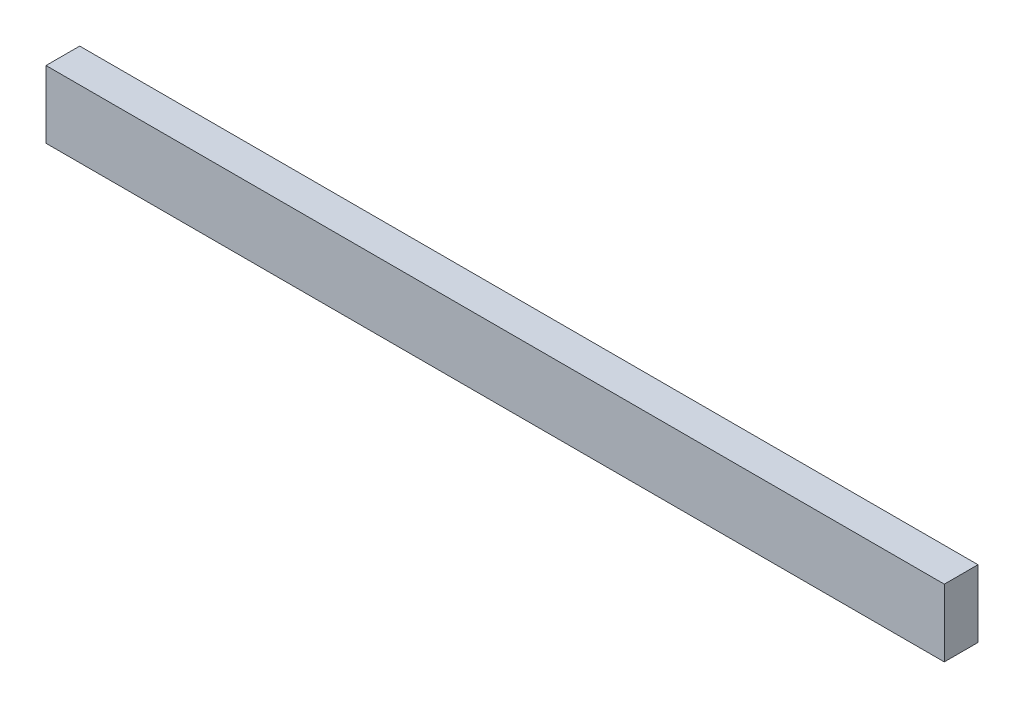
ISO-10303-21;
HEADER;
FILE_DESCRIPTION(('STEP AP214'),'2;1');
FILE_NAME('part.step','',(''),(''),'','','');
FILE_SCHEMA(('AUTOMOTIVE_DESIGN { 1 0 10303 214 1 1 1 1 }'));
ENDSEC;
DATA;
#1=APPLICATION_CONTEXT('core data for automotive mechanical design processes');
#2=APPLICATION_PROTOCOL_DEFINITION('international standard','automotive_design',2000,#1);
#3=PRODUCT_CONTEXT('',#1,'mechanical');
#4=PRODUCT('Part','Part','',(#3));
#5=PRODUCT_RELATED_PRODUCT_CATEGORY('part','',(#4));
#6=PRODUCT_DEFINITION_FORMATION('','',#4);
#7=PRODUCT_DEFINITION_CONTEXT('part definition',#1,'design');
#8=PRODUCT_DEFINITION('design','',#6,#7);
#9=PRODUCT_DEFINITION_SHAPE('','',#8);
#10=(LENGTH_UNIT() NAMED_UNIT(*) SI_UNIT(.MILLI.,.METRE.));
#11=(NAMED_UNIT(*) PLANE_ANGLE_UNIT() SI_UNIT($,.RADIAN.));
#12=(NAMED_UNIT(*) SI_UNIT($,.STERADIAN.) SOLID_ANGLE_UNIT());
#13=UNCERTAINTY_MEASURE_WITH_UNIT(LENGTH_MEASURE(1.E-05),#10,'distance_accuracy_value','');
#14=(GEOMETRIC_REPRESENTATION_CONTEXT(3) GLOBAL_UNCERTAINTY_ASSIGNED_CONTEXT((#13)) GLOBAL_UNIT_ASSIGNED_CONTEXT((#10,
#11,#12)) REPRESENTATION_CONTEXT('',''));
#15=CARTESIAN_POINT('',(0.,0.,0.));
#16=DIRECTION('',(0.,0.,1.));
#17=DIRECTION('',(1.,0.,0.));
#18=AXIS2_PLACEMENT_3D('',#15,#16,#17);
#19=CARTESIAN_POINT('',(40.,3.,3.));
#20=DIRECTION('',(-1.,0.,0.));
#21=DIRECTION('',(0.,0.,1.));
#22=AXIS2_PLACEMENT_3D('',#19,#20,#21);
#23=PLANE('',#22);
#24=DIRECTION('',(0.,1.,0.));
#25=VECTOR('',#24,1.);
#26=CARTESIAN_POINT('',(40.,3.,0.));
#27=LINE('',#26,#25);
#28=CARTESIAN_POINT('',(40.,-3.,0.));
#29=VERTEX_POINT('',#28);
#30=CARTESIAN_POINT('',(40.,3.,0.));
#31=VERTEX_POINT('',#30);
#32=EDGE_CURVE('E95',#29,#31,#27,.T.);
#33=ORIENTED_EDGE('',*,*,#32,.T.);
#34=DIRECTION('',(0.,0.,-1.));
#35=VECTOR('',#34,1.);
#36=CARTESIAN_POINT('',(40.,3.,3.));
#37=LINE('',#36,#35);
#38=CARTESIAN_POINT('',(40.,3.,3.));
#39=VERTEX_POINT('',#38);
#40=EDGE_CURVE('E11',#39,#31,#37,.T.);
#41=ORIENTED_EDGE('',*,*,#40,.F.);
#42=DIRECTION('',(0.,1.,0.));
#43=VECTOR('',#42,1.);
#44=CARTESIAN_POINT('',(40.,3.,3.));
#45=LINE('',#44,#43);
#46=CARTESIAN_POINT('',(40.,-3.,3.));
#47=VERTEX_POINT('',#46);
#48=EDGE_CURVE('E83',#47,#39,#45,.T.);
#49=ORIENTED_EDGE('',*,*,#48,.F.);
#50=DIRECTION('',(0.,0.,-1.));
#51=VECTOR('',#50,1.);
#52=CARTESIAN_POINT('',(40.,-3.,3.));
#53=LINE('',#52,#51);
#54=EDGE_CURVE('E91',#47,#29,#53,.T.);
#55=ORIENTED_EDGE('',*,*,#54,.T.);
#56=EDGE_LOOP('',(#33,#41,#49,#55));
#57=FACE_BOUND('',#56,.T.);
#58=ADVANCED_FACE('F32',(#57),#23,.F.);
#59=CARTESIAN_POINT('',(-40.,3.,3.));
#60=DIRECTION('',(0.,-1.,0.));
#61=DIRECTION('',(0.,0.,-1.));
#62=AXIS2_PLACEMENT_3D('',#59,#60,#61);
#63=PLANE('',#62);
#64=DIRECTION('',(-1.,0.,0.));
#65=VECTOR('',#64,1.);
#66=CARTESIAN_POINT('',(-40.,3.,0.));
#67=LINE('',#66,#65);
#68=CARTESIAN_POINT('',(-40.,3.,0.));
#69=VERTEX_POINT('',#68);
#70=EDGE_CURVE('E87',#31,#69,#67,.T.);
#71=ORIENTED_EDGE('',*,*,#70,.T.);
#72=DIRECTION('',(0.,0.,-1.));
#73=VECTOR('',#72,1.);
#74=CARTESIAN_POINT('',(-40.,3.,3.));
#75=LINE('',#74,#73);
#76=CARTESIAN_POINT('',(-40.,3.,3.));
#77=VERTEX_POINT('',#76);
#78=EDGE_CURVE('E40',#77,#69,#75,.T.);
#79=ORIENTED_EDGE('',*,*,#78,.F.);
#80=DIRECTION('',(-1.,0.,0.));
#81=VECTOR('',#80,1.);
#82=CARTESIAN_POINT('',(-40.,3.,3.));
#83=LINE('',#82,#81);
#84=EDGE_CURVE('E78',#39,#77,#83,.T.);
#85=ORIENTED_EDGE('',*,*,#84,.F.);
#86=ORIENTED_EDGE('',*,*,#40,.T.);
#87=EDGE_LOOP('',(#71,#79,#85,#86));
#88=FACE_BOUND('',#87,.T.);
#89=ADVANCED_FACE('F86',(#88),#63,.F.);
#90=CARTESIAN_POINT('',(-40.,3.,3.));
#91=DIRECTION('',(1.,0.,0.));
#92=DIRECTION('',(0.,0.,-1.));
#93=AXIS2_PLACEMENT_3D('',#90,#91,#92);
#94=PLANE('',#93);
#95=DIRECTION('',(0.,-1.,0.));
#96=VECTOR('',#95,1.);
#97=CARTESIAN_POINT('',(-40.,3.,0.));
#98=LINE('',#97,#96);
#99=CARTESIAN_POINT('',(-40.,-3.,0.));
#100=VERTEX_POINT('',#99);
#101=EDGE_CURVE('E65',#69,#100,#98,.T.);
#102=ORIENTED_EDGE('',*,*,#101,.T.);
#103=DIRECTION('',(0.,0.,-1.));
#104=VECTOR('',#103,1.);
#105=CARTESIAN_POINT('',(-40.,-3.,3.));
#106=LINE('',#105,#104);
#107=CARTESIAN_POINT('',(-40.,-3.,3.));
#108=VERTEX_POINT('',#107);
#109=EDGE_CURVE('E88',#108,#100,#106,.T.);
#110=ORIENTED_EDGE('',*,*,#109,.F.);
#111=DIRECTION('',(0.,-1.,0.));
#112=VECTOR('',#111,1.);
#113=CARTESIAN_POINT('',(-40.,3.,3.));
#114=LINE('',#113,#112);
#115=EDGE_CURVE('E81',#77,#108,#114,.T.);
#116=ORIENTED_EDGE('',*,*,#115,.F.);
#117=ORIENTED_EDGE('',*,*,#78,.T.);
#118=EDGE_LOOP('',(#102,#110,#116,#117));
#119=FACE_BOUND('',#118,.T.);
#120=ADVANCED_FACE('F89',(#119),#94,.F.);
#121=CARTESIAN_POINT('',(-40.,-3.,3.));
#122=DIRECTION('',(0.,1.,0.));
#123=DIRECTION('',(0.,0.,1.));
#124=AXIS2_PLACEMENT_3D('',#121,#122,#123);
#125=PLANE('',#124);
#126=DIRECTION('',(1.,0.,0.));
#127=VECTOR('',#126,1.);
#128=CARTESIAN_POINT('',(-40.,-3.,0.));
#129=LINE('',#128,#127);
#130=EDGE_CURVE('E71',#100,#29,#129,.T.);
#131=ORIENTED_EDGE('',*,*,#130,.T.);
#132=ORIENTED_EDGE('',*,*,#54,.F.);
#133=DIRECTION('',(1.,0.,0.));
#134=VECTOR('',#133,1.);
#135=CARTESIAN_POINT('',(-40.,-3.,3.));
#136=LINE('',#135,#134);
#137=EDGE_CURVE('E48',#108,#47,#136,.T.);
#138=ORIENTED_EDGE('',*,*,#137,.F.);
#139=ORIENTED_EDGE('',*,*,#109,.T.);
#140=EDGE_LOOP('',(#131,#132,#138,#139));
#141=FACE_BOUND('',#140,.T.);
#142=ADVANCED_FACE('F102',(#141),#125,.F.);
#143=CARTESIAN_POINT('',(0.,0.,3.));
#144=DIRECTION('',(0.,0.,1.));
#145=DIRECTION('',(1.,0.,0.));
#146=AXIS2_PLACEMENT_3D('',#143,#144,#145);
#147=PLANE('',#146);
#148=ORIENTED_EDGE('',*,*,#48,.T.);
#149=ORIENTED_EDGE('',*,*,#84,.T.);
#150=ORIENTED_EDGE('',*,*,#115,.T.);
#151=ORIENTED_EDGE('',*,*,#137,.T.);
#152=EDGE_LOOP('',(#148,#149,#150,#151));
#153=FACE_BOUND('',#152,.T.);
#154=ADVANCED_FACE('F79',(#153),#147,.T.);
#155=CARTESIAN_POINT('',(0.,0.,0.));
#156=DIRECTION('',(0.,0.,1.));
#157=DIRECTION('',(1.,0.,0.));
#158=AXIS2_PLACEMENT_3D('',#155,#156,#157);
#159=PLANE('',#158);
#160=ORIENTED_EDGE('',*,*,#32,.F.);
#161=ORIENTED_EDGE('',*,*,#130,.F.);
#162=ORIENTED_EDGE('',*,*,#101,.F.);
#163=ORIENTED_EDGE('',*,*,#70,.F.);
#164=EDGE_LOOP('',(#160,#161,#162,#163));
#165=FACE_BOUND('',#164,.T.);
#166=ADVANCED_FACE('F105',(#165),#159,.F.);
#167=CLOSED_SHELL('',(#58,#89,#120,#142,#154,#166));
#168=MANIFOLD_SOLID_BREP('B2',#167);
#169=ADVANCED_BREP_SHAPE_REPRESENTATION('',(#18,#168),#14);
#170=SHAPE_DEFINITION_REPRESENTATION(#9,#169);
ENDSEC;
END-ISO-10303-21;
